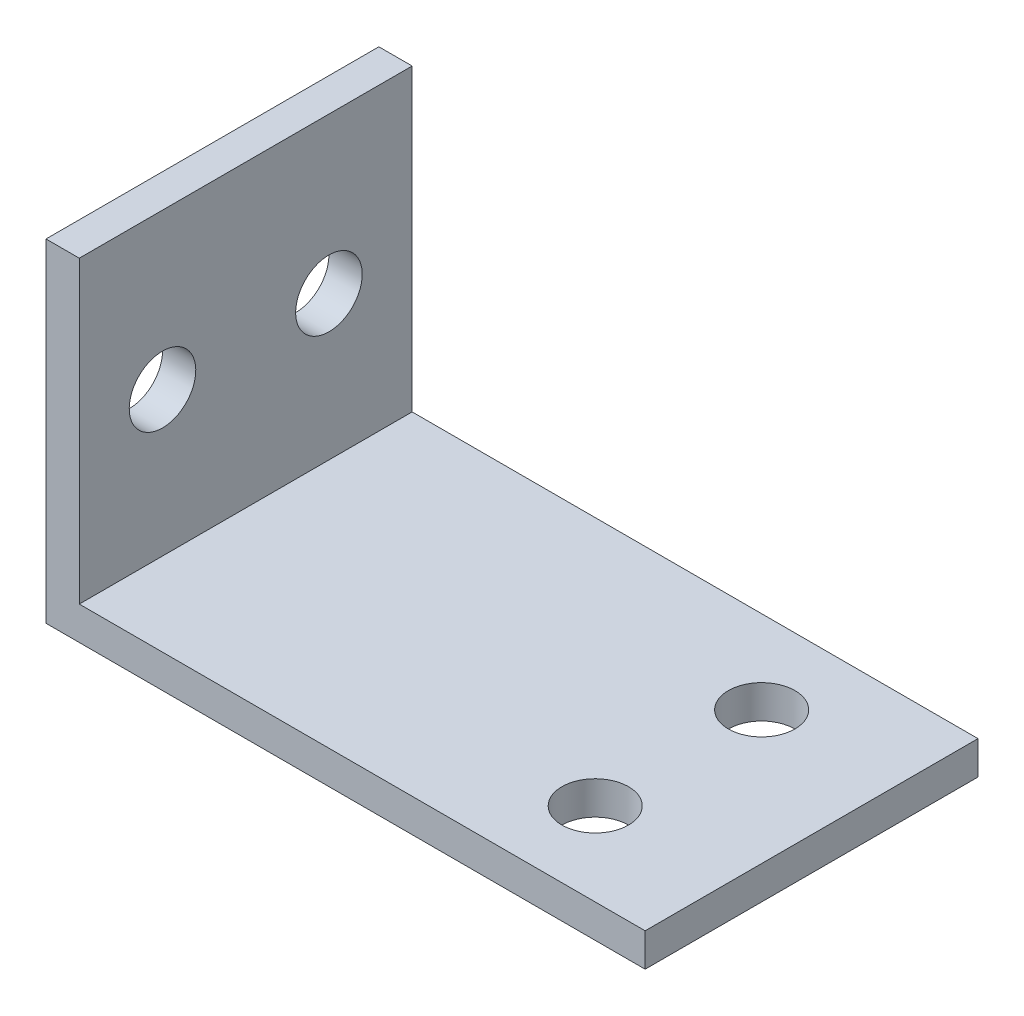
ISO-10303-21;
HEADER;
FILE_DESCRIPTION(('STEP AP214'),'2;1');
FILE_NAME('part.step','',(''),(''),'','','');
FILE_SCHEMA(('AUTOMOTIVE_DESIGN { 1 0 10303 214 1 1 1 1 }'));
ENDSEC;
DATA;
#1=APPLICATION_CONTEXT('core data for automotive mechanical design processes');
#2=APPLICATION_PROTOCOL_DEFINITION('international standard','automotive_design',2000,#1);
#3=PRODUCT_CONTEXT('',#1,'mechanical');
#4=PRODUCT('Part','Part','',(#3));
#5=PRODUCT_RELATED_PRODUCT_CATEGORY('part','',(#4));
#6=PRODUCT_DEFINITION_FORMATION('','',#4);
#7=PRODUCT_DEFINITION_CONTEXT('part definition',#1,'design');
#8=PRODUCT_DEFINITION('design','',#6,#7);
#9=PRODUCT_DEFINITION_SHAPE('','',#8);
#10=(LENGTH_UNIT() NAMED_UNIT(*) SI_UNIT(.MILLI.,.METRE.));
#11=(NAMED_UNIT(*) PLANE_ANGLE_UNIT() SI_UNIT($,.RADIAN.));
#12=(NAMED_UNIT(*) SI_UNIT($,.STERADIAN.) SOLID_ANGLE_UNIT());
#13=UNCERTAINTY_MEASURE_WITH_UNIT(LENGTH_MEASURE(1.E-05),#10,'distance_accuracy_value','');
#14=(GEOMETRIC_REPRESENTATION_CONTEXT(3) GLOBAL_UNCERTAINTY_ASSIGNED_CONTEXT((#13)) GLOBAL_UNIT_ASSIGNED_CONTEXT((#10,
#11,#12)) REPRESENTATION_CONTEXT('',''));
#15=CARTESIAN_POINT('',(0.,0.,0.));
#16=DIRECTION('',(0.,0.,1.));
#17=DIRECTION('',(1.,0.,0.));
#18=AXIS2_PLACEMENT_3D('',#15,#16,#17);
#19=CARTESIAN_POINT('',(11.,51.,15.));
#20=DIRECTION('',(1.,0.,0.));
#21=DIRECTION('',(0.,1.,0.));
#22=AXIS2_PLACEMENT_3D('',#19,#20,#21);
#23=PLANE('',#22);
#24=CARTESIAN_POINT('',(11.,37.,7.5));
#25=DIRECTION('',(1.,0.,0.));
#26=DIRECTION('',(0.,1.,0.));
#27=AXIS2_PLACEMENT_3D('',#24,#25,#26);
#28=CIRCLE('',#27,3.);
#29=CARTESIAN_POINT('',(11.,40.,7.5));
#30=VERTEX_POINT('',#29);
#31=EDGE_CURVE('E175',#30,#30,#28,.F.);
#32=ORIENTED_EDGE('',*,*,#31,.F.);
#33=EDGE_LOOP('',(#32));
#34=FACE_BOUND('',#33,.T.);
#35=CARTESIAN_POINT('',(11.,37.,-7.5));
#36=DIRECTION('',(1.,0.,0.));
#37=DIRECTION('',(0.,1.,0.));
#38=AXIS2_PLACEMENT_3D('',#35,#36,#37);
#39=CIRCLE('',#38,3.);
#40=CARTESIAN_POINT('',(11.,40.,-7.5));
#41=VERTEX_POINT('',#40);
#42=EDGE_CURVE('E178',#41,#41,#39,.F.);
#43=ORIENTED_EDGE('',*,*,#42,.F.);
#44=EDGE_LOOP('',(#43));
#45=FACE_BOUND('',#44,.T.);
#46=DIRECTION('',(0.,0.,-1.));
#47=VECTOR('',#46,1.);
#48=CARTESIAN_POINT('',(11.,51.,15.));
#49=LINE('',#48,#47);
#50=CARTESIAN_POINT('',(11.,51.,15.));
#51=VERTEX_POINT('',#50);
#52=CARTESIAN_POINT('',(11.,51.,-15.));
#53=VERTEX_POINT('',#52);
#54=EDGE_CURVE('E109',#51,#53,#49,.T.);
#55=ORIENTED_EDGE('',*,*,#54,.T.);
#56=DIRECTION('',(0.,-1.,0.));
#57=VECTOR('',#56,1.);
#58=CARTESIAN_POINT('',(11.,51.,-15.));
#59=LINE('',#58,#57);
#60=CARTESIAN_POINT('',(11.,21.,-15.));
#61=VERTEX_POINT('',#60);
#62=EDGE_CURVE('E103',#53,#61,#59,.T.);
#63=ORIENTED_EDGE('',*,*,#62,.T.);
#64=DIRECTION('',(0.,0.,-1.));
#65=VECTOR('',#64,1.);
#66=CARTESIAN_POINT('',(11.,21.,15.));
#67=LINE('',#66,#65);
#68=CARTESIAN_POINT('',(11.,21.,15.));
#69=VERTEX_POINT('',#68);
#70=EDGE_CURVE('E11',#69,#61,#67,.T.);
#71=ORIENTED_EDGE('',*,*,#70,.F.);
#72=DIRECTION('',(0.,-1.,0.));
#73=VECTOR('',#72,1.);
#74=CARTESIAN_POINT('',(11.,51.,15.));
#75=LINE('',#74,#73);
#76=EDGE_CURVE('E126',#51,#69,#75,.T.);
#77=ORIENTED_EDGE('',*,*,#76,.F.);
#78=EDGE_LOOP('',(#55,#63,#71,#77));
#79=FACE_BOUND('',#78,.T.);
#80=ADVANCED_FACE('F39',(#34,#45,#79),#23,.F.);
#81=CARTESIAN_POINT('',(11.,21.,15.));
#82=DIRECTION('',(0.,1.,0.));
#83=DIRECTION('',(0.,0.,1.));
#84=AXIS2_PLACEMENT_3D('',#81,#82,#83);
#85=PLANE('',#84);
#86=CARTESIAN_POINT('',(53.,21.,7.5));
#87=DIRECTION('',(0.,1.,0.));
#88=DIRECTION('',(0.,0.,1.));
#89=AXIS2_PLACEMENT_3D('',#86,#87,#88);
#90=CIRCLE('',#89,3.);
#91=CARTESIAN_POINT('',(53.,21.,10.5));
#92=VERTEX_POINT('',#91);
#93=EDGE_CURVE('E110',#92,#92,#90,.F.);
#94=ORIENTED_EDGE('',*,*,#93,.F.);
#95=EDGE_LOOP('',(#94));
#96=FACE_BOUND('',#95,.T.);
#97=CARTESIAN_POINT('',(53.,21.,-7.5));
#98=DIRECTION('',(0.,1.,0.));
#99=DIRECTION('',(0.,0.,1.));
#100=AXIS2_PLACEMENT_3D('',#97,#98,#99);
#101=CIRCLE('',#100,3.);
#102=CARTESIAN_POINT('',(53.,21.,-4.5));
#103=VERTEX_POINT('',#102);
#104=EDGE_CURVE('E113',#103,#103,#101,.F.);
#105=ORIENTED_EDGE('',*,*,#104,.F.);
#106=EDGE_LOOP('',(#105));
#107=FACE_BOUND('',#106,.T.);
#108=ORIENTED_EDGE('',*,*,#70,.T.);
#109=DIRECTION('',(1.,0.,0.));
#110=VECTOR('',#109,1.);
#111=CARTESIAN_POINT('',(11.,21.,-15.));
#112=LINE('',#111,#110);
#113=CARTESIAN_POINT('',(65.,21.,-15.));
#114=VERTEX_POINT('',#113);
#115=EDGE_CURVE('E93',#61,#114,#112,.T.);
#116=ORIENTED_EDGE('',*,*,#115,.T.);
#117=DIRECTION('',(0.,0.,-1.));
#118=VECTOR('',#117,1.);
#119=CARTESIAN_POINT('',(65.,21.,15.));
#120=LINE('',#119,#118);
#121=CARTESIAN_POINT('',(65.,21.,15.));
#122=VERTEX_POINT('',#121);
#123=EDGE_CURVE('E46',#122,#114,#120,.T.);
#124=ORIENTED_EDGE('',*,*,#123,.F.);
#125=DIRECTION('',(1.,0.,0.));
#126=VECTOR('',#125,1.);
#127=CARTESIAN_POINT('',(11.,21.,15.));
#128=LINE('',#127,#126);
#129=EDGE_CURVE('E94',#69,#122,#128,.T.);
#130=ORIENTED_EDGE('',*,*,#129,.F.);
#131=EDGE_LOOP('',(#108,#116,#124,#130));
#132=FACE_BOUND('',#131,.T.);
#133=ADVANCED_FACE('F91',(#96,#107,#132),#85,.F.);
#134=CARTESIAN_POINT('',(65.,21.,15.));
#135=DIRECTION('',(-1.,0.,0.));
#136=DIRECTION('',(0.,0.,1.));
#137=AXIS2_PLACEMENT_3D('',#134,#135,#136);
#138=PLANE('',#137);
#139=ORIENTED_EDGE('',*,*,#123,.T.);
#140=DIRECTION('',(0.,1.,0.));
#141=VECTOR('',#140,1.);
#142=CARTESIAN_POINT('',(65.,21.,-15.));
#143=LINE('',#142,#141);
#144=CARTESIAN_POINT('',(65.,24.,-15.));
#145=VERTEX_POINT('',#144);
#146=EDGE_CURVE('E107',#114,#145,#143,.T.);
#147=ORIENTED_EDGE('',*,*,#146,.T.);
#148=DIRECTION('',(0.,0.,-1.));
#149=VECTOR('',#148,1.);
#150=CARTESIAN_POINT('',(65.,24.,15.));
#151=LINE('',#150,#149);
#152=CARTESIAN_POINT('',(65.,24.,15.));
#153=VERTEX_POINT('',#152);
#154=EDGE_CURVE('E140',#153,#145,#151,.T.);
#155=ORIENTED_EDGE('',*,*,#154,.F.);
#156=DIRECTION('',(0.,1.,0.));
#157=VECTOR('',#156,1.);
#158=CARTESIAN_POINT('',(65.,21.,15.));
#159=LINE('',#158,#157);
#160=EDGE_CURVE('E129',#122,#153,#159,.T.);
#161=ORIENTED_EDGE('',*,*,#160,.F.);
#162=EDGE_LOOP('',(#139,#147,#155,#161));
#163=FACE_BOUND('',#162,.T.);
#164=ADVANCED_FACE('F143',(#163),#138,.F.);
#165=CARTESIAN_POINT('',(65.,24.,15.));
#166=DIRECTION('',(0.,-1.,0.));
#167=DIRECTION('',(1.,0.,0.));
#168=AXIS2_PLACEMENT_3D('',#165,#166,#167);
#169=PLANE('',#168);
#170=CARTESIAN_POINT('',(53.,24.,7.5));
#171=DIRECTION('',(0.,-1.,0.));
#172=DIRECTION('',(1.,0.,0.));
#173=AXIS2_PLACEMENT_3D('',#170,#171,#172);
#174=CIRCLE('',#173,3.);
#175=CARTESIAN_POINT('',(56.,24.,7.5));
#176=VERTEX_POINT('',#175);
#177=EDGE_CURVE('E189',#176,#176,#174,.T.);
#178=ORIENTED_EDGE('',*,*,#177,.T.);
#179=EDGE_LOOP('',(#178));
#180=FACE_BOUND('',#179,.T.);
#181=CARTESIAN_POINT('',(53.,24.,-7.5));
#182=DIRECTION('',(0.,-1.,0.));
#183=DIRECTION('',(1.,0.,0.));
#184=AXIS2_PLACEMENT_3D('',#181,#182,#183);
#185=CIRCLE('',#184,3.);
#186=CARTESIAN_POINT('',(56.,24.,-7.5));
#187=VERTEX_POINT('',#186);
#188=EDGE_CURVE('E182',#187,#187,#185,.T.);
#189=ORIENTED_EDGE('',*,*,#188,.T.);
#190=EDGE_LOOP('',(#189));
#191=FACE_BOUND('',#190,.T.);
#192=ORIENTED_EDGE('',*,*,#154,.T.);
#193=DIRECTION('',(-1.,0.,0.));
#194=VECTOR('',#193,1.);
#195=CARTESIAN_POINT('',(65.,24.,-15.));
#196=LINE('',#195,#194);
#197=CARTESIAN_POINT('',(14.,24.,-15.));
#198=VERTEX_POINT('',#197);
#199=EDGE_CURVE('E118',#145,#198,#196,.T.);
#200=ORIENTED_EDGE('',*,*,#199,.T.);
#201=DIRECTION('',(0.,0.,-1.));
#202=VECTOR('',#201,1.);
#203=CARTESIAN_POINT('',(14.,24.,15.));
#204=LINE('',#203,#202);
#205=CARTESIAN_POINT('',(14.,24.,15.));
#206=VERTEX_POINT('',#205);
#207=EDGE_CURVE('E138',#206,#198,#204,.T.);
#208=ORIENTED_EDGE('',*,*,#207,.F.);
#209=DIRECTION('',(-1.,0.,0.));
#210=VECTOR('',#209,1.);
#211=CARTESIAN_POINT('',(65.,24.,15.));
#212=LINE('',#211,#210);
#213=EDGE_CURVE('E131',#153,#206,#212,.T.);
#214=ORIENTED_EDGE('',*,*,#213,.F.);
#215=EDGE_LOOP('',(#192,#200,#208,#214));
#216=FACE_BOUND('',#215,.T.);
#217=ADVANCED_FACE('F149',(#180,#191,#216),#169,.F.);
#218=CARTESIAN_POINT('',(14.,24.,15.));
#219=DIRECTION('',(-1.,0.,0.));
#220=DIRECTION('',(0.,-1.,0.));
#221=AXIS2_PLACEMENT_3D('',#218,#219,#220);
#222=PLANE('',#221);
#223=CARTESIAN_POINT('',(14.,37.,7.5));
#224=DIRECTION('',(-1.,0.,0.));
#225=DIRECTION('',(0.,-1.,0.));
#226=AXIS2_PLACEMENT_3D('',#223,#224,#225);
#227=CIRCLE('',#226,3.);
#228=CARTESIAN_POINT('',(14.,34.,7.5));
#229=VERTEX_POINT('',#228);
#230=EDGE_CURVE('E180',#229,#229,#227,.T.);
#231=ORIENTED_EDGE('',*,*,#230,.T.);
#232=EDGE_LOOP('',(#231));
#233=FACE_BOUND('',#232,.T.);
#234=CARTESIAN_POINT('',(14.,37.,-7.5));
#235=DIRECTION('',(-1.,0.,0.));
#236=DIRECTION('',(0.,-1.,0.));
#237=AXIS2_PLACEMENT_3D('',#234,#235,#236);
#238=CIRCLE('',#237,3.);
#239=CARTESIAN_POINT('',(14.,34.,-7.5));
#240=VERTEX_POINT('',#239);
#241=EDGE_CURVE('E185',#240,#240,#238,.T.);
#242=ORIENTED_EDGE('',*,*,#241,.T.);
#243=EDGE_LOOP('',(#242));
#244=FACE_BOUND('',#243,.T.);
#245=ORIENTED_EDGE('',*,*,#207,.T.);
#246=DIRECTION('',(0.,1.,0.));
#247=VECTOR('',#246,1.);
#248=CARTESIAN_POINT('',(14.,24.,-15.));
#249=LINE('',#248,#247);
#250=CARTESIAN_POINT('',(14.,51.,-15.));
#251=VERTEX_POINT('',#250);
#252=EDGE_CURVE('E121',#198,#251,#249,.T.);
#253=ORIENTED_EDGE('',*,*,#252,.T.);
#254=DIRECTION('',(0.,0.,-1.));
#255=VECTOR('',#254,1.);
#256=CARTESIAN_POINT('',(14.,51.,15.));
#257=LINE('',#256,#255);
#258=CARTESIAN_POINT('',(14.,51.,15.));
#259=VERTEX_POINT('',#258);
#260=EDGE_CURVE('E136',#259,#251,#257,.T.);
#261=ORIENTED_EDGE('',*,*,#260,.F.);
#262=DIRECTION('',(0.,1.,0.));
#263=VECTOR('',#262,1.);
#264=CARTESIAN_POINT('',(14.,24.,15.));
#265=LINE('',#264,#263);
#266=EDGE_CURVE('E58',#206,#259,#265,.T.);
#267=ORIENTED_EDGE('',*,*,#266,.F.);
#268=EDGE_LOOP('',(#245,#253,#261,#267));
#269=FACE_BOUND('',#268,.T.);
#270=ADVANCED_FACE('F152',(#233,#244,#269),#222,.F.);
#271=CARTESIAN_POINT('',(14.,51.,15.));
#272=DIRECTION('',(0.,-1.,0.));
#273=DIRECTION('',(0.,0.,-1.));
#274=AXIS2_PLACEMENT_3D('',#271,#272,#273);
#275=PLANE('',#274);
#276=ORIENTED_EDGE('',*,*,#260,.T.);
#277=DIRECTION('',(-1.,0.,0.));
#278=VECTOR('',#277,1.);
#279=CARTESIAN_POINT('',(14.,51.,-15.));
#280=LINE('',#279,#278);
#281=EDGE_CURVE('E124',#251,#53,#280,.T.);
#282=ORIENTED_EDGE('',*,*,#281,.T.);
#283=ORIENTED_EDGE('',*,*,#54,.F.);
#284=DIRECTION('',(-1.,0.,0.));
#285=VECTOR('',#284,1.);
#286=CARTESIAN_POINT('',(14.,51.,15.));
#287=LINE('',#286,#285);
#288=EDGE_CURVE('E53',#259,#51,#287,.T.);
#289=ORIENTED_EDGE('',*,*,#288,.F.);
#290=EDGE_LOOP('',(#276,#282,#283,#289));
#291=FACE_BOUND('',#290,.T.);
#292=ADVANCED_FACE('F154',(#291),#275,.F.);
#293=CARTESIAN_POINT('',(0.,0.,15.));
#294=DIRECTION('',(0.,0.,1.));
#295=DIRECTION('',(1.,0.,0.));
#296=AXIS2_PLACEMENT_3D('',#293,#294,#295);
#297=PLANE('',#296);
#298=ORIENTED_EDGE('',*,*,#76,.T.);
#299=ORIENTED_EDGE('',*,*,#129,.T.);
#300=ORIENTED_EDGE('',*,*,#160,.T.);
#301=ORIENTED_EDGE('',*,*,#213,.T.);
#302=ORIENTED_EDGE('',*,*,#266,.T.);
#303=ORIENTED_EDGE('',*,*,#288,.T.);
#304=EDGE_LOOP('',(#298,#299,#300,#301,#302,#303));
#305=FACE_BOUND('',#304,.T.);
#306=ADVANCED_FACE('F146',(#305),#297,.T.);
#307=CARTESIAN_POINT('',(0.,0.,-15.));
#308=DIRECTION('',(0.,0.,1.));
#309=DIRECTION('',(1.,0.,0.));
#310=AXIS2_PLACEMENT_3D('',#307,#308,#309);
#311=PLANE('',#310);
#312=ORIENTED_EDGE('',*,*,#62,.F.);
#313=ORIENTED_EDGE('',*,*,#281,.F.);
#314=ORIENTED_EDGE('',*,*,#252,.F.);
#315=ORIENTED_EDGE('',*,*,#199,.F.);
#316=ORIENTED_EDGE('',*,*,#146,.F.);
#317=ORIENTED_EDGE('',*,*,#115,.F.);
#318=EDGE_LOOP('',(#312,#313,#314,#315,#316,#317));
#319=FACE_BOUND('',#318,.T.);
#320=ADVANCED_FACE('F101',(#319),#311,.F.);
#321=CARTESIAN_POINT('',(53.,32.4852813742386,-7.5));
#322=DIRECTION('',(0.,-1.,0.));
#323=DIRECTION('',(0.,0.,-1.));
#324=AXIS2_PLACEMENT_3D('',#321,#322,#323);
#325=CYLINDRICAL_SURFACE('',#324,3.);
#326=ORIENTED_EDGE('',*,*,#188,.F.);
#327=EDGE_LOOP('',(#326));
#328=FACE_BOUND('',#327,.T.);
#329=ORIENTED_EDGE('',*,*,#104,.T.);
#330=EDGE_LOOP('',(#329));
#331=FACE_BOUND('',#330,.T.);
#332=ADVANCED_FACE('F196',(#328,#331),#325,.F.);
#333=CARTESIAN_POINT('',(53.,32.4852813742386,7.5));
#334=DIRECTION('',(0.,-1.,0.));
#335=DIRECTION('',(0.,0.,-1.));
#336=AXIS2_PLACEMENT_3D('',#333,#334,#335);
#337=CYLINDRICAL_SURFACE('',#336,3.);
#338=ORIENTED_EDGE('',*,*,#177,.F.);
#339=EDGE_LOOP('',(#338));
#340=FACE_BOUND('',#339,.T.);
#341=ORIENTED_EDGE('',*,*,#93,.T.);
#342=EDGE_LOOP('',(#341));
#343=FACE_BOUND('',#342,.T.);
#344=ADVANCED_FACE('F199',(#340,#343),#337,.F.);
#345=CARTESIAN_POINT('',(22.4852813742386,37.,-7.5));
#346=DIRECTION('',(-1.,0.,0.));
#347=DIRECTION('',(0.,0.,1.));
#348=AXIS2_PLACEMENT_3D('',#345,#346,#347);
#349=CYLINDRICAL_SURFACE('',#348,3.);
#350=ORIENTED_EDGE('',*,*,#241,.F.);
#351=EDGE_LOOP('',(#350));
#352=FACE_BOUND('',#351,.T.);
#353=ORIENTED_EDGE('',*,*,#42,.T.);
#354=EDGE_LOOP('',(#353));
#355=FACE_BOUND('',#354,.T.);
#356=ADVANCED_FACE('F205',(#352,#355),#349,.F.);
#357=CARTESIAN_POINT('',(22.4852813742386,37.,7.5));
#358=DIRECTION('',(-1.,0.,0.));
#359=DIRECTION('',(0.,0.,1.));
#360=AXIS2_PLACEMENT_3D('',#357,#358,#359);
#361=CYLINDRICAL_SURFACE('',#360,3.);
#362=ORIENTED_EDGE('',*,*,#230,.F.);
#363=EDGE_LOOP('',(#362));
#364=FACE_BOUND('',#363,.T.);
#365=ORIENTED_EDGE('',*,*,#31,.T.);
#366=EDGE_LOOP('',(#365));
#367=FACE_BOUND('',#366,.T.);
#368=ADVANCED_FACE('F214',(#364,#367),#361,.F.);
#369=CLOSED_SHELL('',(#80,#133,#164,#217,#270,#292,#306,#320,#332,#344,#356,#368));
#370=MANIFOLD_SOLID_BREP('B2',#369);
#371=ADVANCED_BREP_SHAPE_REPRESENTATION('',(#18,#370),#14);
#372=SHAPE_DEFINITION_REPRESENTATION(#9,#371);
ENDSEC;
END-ISO-10303-21;
